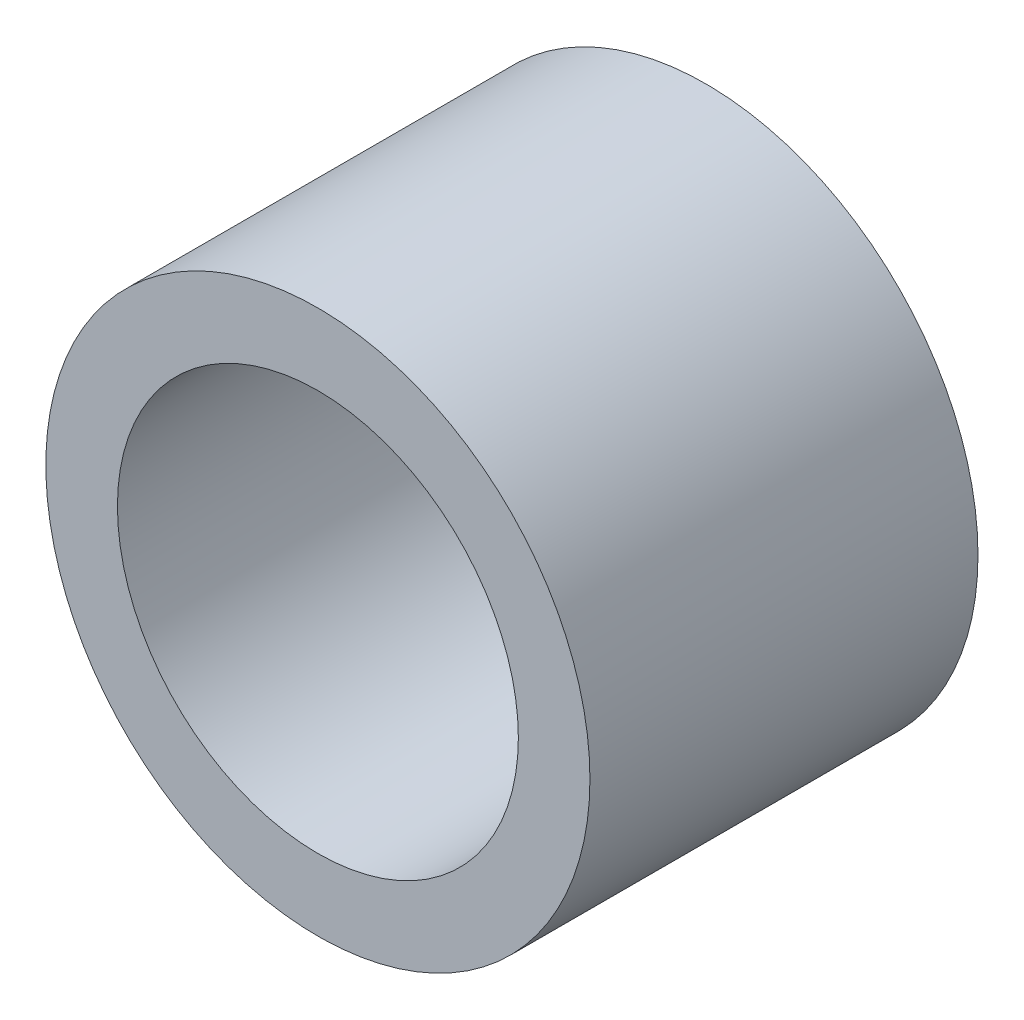
ISO-10303-21;
HEADER;
FILE_DESCRIPTION(('STEP AP214'),'2;1');
FILE_NAME('part.step','',(''),(''),'','','');
FILE_SCHEMA(('AUTOMOTIVE_DESIGN { 1 0 10303 214 1 1 1 1 }'));
ENDSEC;
DATA;
#1=APPLICATION_CONTEXT('core data for automotive mechanical design processes');
#2=APPLICATION_PROTOCOL_DEFINITION('international standard','automotive_design',2000,#1);
#3=PRODUCT_CONTEXT('',#1,'mechanical');
#4=PRODUCT('Part','Part','',(#3));
#5=PRODUCT_RELATED_PRODUCT_CATEGORY('part','',(#4));
#6=PRODUCT_DEFINITION_FORMATION('','',#4);
#7=PRODUCT_DEFINITION_CONTEXT('part definition',#1,'design');
#8=PRODUCT_DEFINITION('design','',#6,#7);
#9=PRODUCT_DEFINITION_SHAPE('','',#8);
#10=(LENGTH_UNIT() NAMED_UNIT(*) SI_UNIT(.MILLI.,.METRE.));
#11=(NAMED_UNIT(*) PLANE_ANGLE_UNIT() SI_UNIT($,.RADIAN.));
#12=(NAMED_UNIT(*) SI_UNIT($,.STERADIAN.) SOLID_ANGLE_UNIT());
#13=UNCERTAINTY_MEASURE_WITH_UNIT(LENGTH_MEASURE(1.E-05),#10,'distance_accuracy_value','');
#14=(GEOMETRIC_REPRESENTATION_CONTEXT(3) GLOBAL_UNCERTAINTY_ASSIGNED_CONTEXT((#13)) GLOBAL_UNIT_ASSIGNED_CONTEXT((#10,
#11,#12)) REPRESENTATION_CONTEXT('',''));
#15=CARTESIAN_POINT('',(0.,0.,0.));
#16=DIRECTION('',(0.,0.,1.));
#17=DIRECTION('',(1.,0.,0.));
#18=AXIS2_PLACEMENT_3D('',#15,#16,#17);
#19=CARTESIAN_POINT('',(0.,0.,6.8834));
#20=DIRECTION('',(0.,0.,1.));
#21=DIRECTION('',(1.,0.,0.));
#22=AXIS2_PLACEMENT_3D('',#19,#20,#21);
#23=PLANE('',#22);
#24=CARTESIAN_POINT('',(0.,0.,6.8834));
#25=DIRECTION('',(0.,0.,1.));
#26=DIRECTION('',(1.,0.,0.));
#27=AXIS2_PLACEMENT_3D('',#24,#25,#26);
#28=CIRCLE('',#27,4.826);
#29=CARTESIAN_POINT('',(4.826,0.,6.8834));
#30=VERTEX_POINT('',#29);
#31=EDGE_CURVE('E10',#30,#30,#28,.T.);
#32=ORIENTED_EDGE('',*,*,#31,.T.);
#33=EDGE_LOOP('',(#32));
#34=FACE_BOUND('',#33,.T.);
#35=CARTESIAN_POINT('',(0.,0.,6.8834));
#36=DIRECTION('',(0.,0.,1.));
#37=DIRECTION('',(1.,0.,0.));
#38=AXIS2_PLACEMENT_3D('',#35,#36,#37);
#39=CIRCLE('',#38,3.556);
#40=CARTESIAN_POINT('',(3.556,0.,6.8834));
#41=VERTEX_POINT('',#40);
#42=EDGE_CURVE('E42',#41,#41,#39,.T.);
#43=ORIENTED_EDGE('',*,*,#42,.F.);
#44=EDGE_LOOP('',(#43));
#45=FACE_BOUND('',#44,.T.);
#46=ADVANCED_FACE('F31',(#34,#45),#23,.T.);
#47=CARTESIAN_POINT('',(0.,0.,0.));
#48=DIRECTION('',(0.,0.,1.));
#49=DIRECTION('',(1.,0.,0.));
#50=AXIS2_PLACEMENT_3D('',#47,#48,#49);
#51=PLANE('',#50);
#52=CARTESIAN_POINT('',(0.,0.,0.));
#53=DIRECTION('',(0.,0.,1.));
#54=DIRECTION('',(1.,0.,0.));
#55=AXIS2_PLACEMENT_3D('',#52,#53,#54);
#56=CIRCLE('',#55,4.826);
#57=CARTESIAN_POINT('',(4.826,0.,0.));
#58=VERTEX_POINT('',#57);
#59=EDGE_CURVE('E35',#58,#58,#56,.T.);
#60=ORIENTED_EDGE('',*,*,#59,.F.);
#61=EDGE_LOOP('',(#60));
#62=FACE_BOUND('',#61,.T.);
#63=CARTESIAN_POINT('',(0.,0.,0.));
#64=DIRECTION('',(0.,0.,1.));
#65=DIRECTION('',(1.,0.,0.));
#66=AXIS2_PLACEMENT_3D('',#63,#64,#65);
#67=CIRCLE('',#66,3.556);
#68=CARTESIAN_POINT('',(3.556,0.,0.));
#69=VERTEX_POINT('',#68);
#70=EDGE_CURVE('E44',#69,#69,#67,.T.);
#71=ORIENTED_EDGE('',*,*,#70,.T.);
#72=EDGE_LOOP('',(#71));
#73=FACE_BOUND('',#72,.T.);
#74=ADVANCED_FACE('F54',(#62,#73),#51,.F.);
#75=CARTESIAN_POINT('',(0.,0.,6.8834));
#76=DIRECTION('',(0.,0.,-1.));
#77=DIRECTION('',(-1.,0.,0.));
#78=AXIS2_PLACEMENT_3D('',#75,#76,#77);
#79=CYLINDRICAL_SURFACE('',#78,4.826);
#80=ORIENTED_EDGE('',*,*,#31,.F.);
#81=EDGE_LOOP('',(#80));
#82=FACE_BOUND('',#81,.T.);
#83=ORIENTED_EDGE('',*,*,#59,.T.);
#84=EDGE_LOOP('',(#83));
#85=FACE_BOUND('',#84,.T.);
#86=ADVANCED_FACE('F33',(#82,#85),#79,.T.);
#87=CARTESIAN_POINT('',(0.,0.,6.8834));
#88=DIRECTION('',(0.,0.,-1.));
#89=DIRECTION('',(-1.,0.,0.));
#90=AXIS2_PLACEMENT_3D('',#87,#88,#89);
#91=CYLINDRICAL_SURFACE('',#90,3.556);
#92=ORIENTED_EDGE('',*,*,#42,.T.);
#93=EDGE_LOOP('',(#92));
#94=FACE_BOUND('',#93,.T.);
#95=ORIENTED_EDGE('',*,*,#70,.F.);
#96=EDGE_LOOP('',(#95));
#97=FACE_BOUND('',#96,.T.);
#98=ADVANCED_FACE('F50',(#94,#97),#91,.F.);
#99=CLOSED_SHELL('',(#46,#74,#86,#98));
#100=MANIFOLD_SOLID_BREP('B2',#99);
#101=ADVANCED_BREP_SHAPE_REPRESENTATION('',(#18,#100),#14);
#102=SHAPE_DEFINITION_REPRESENTATION(#9,#101);
ENDSEC;
END-ISO-10303-21;
